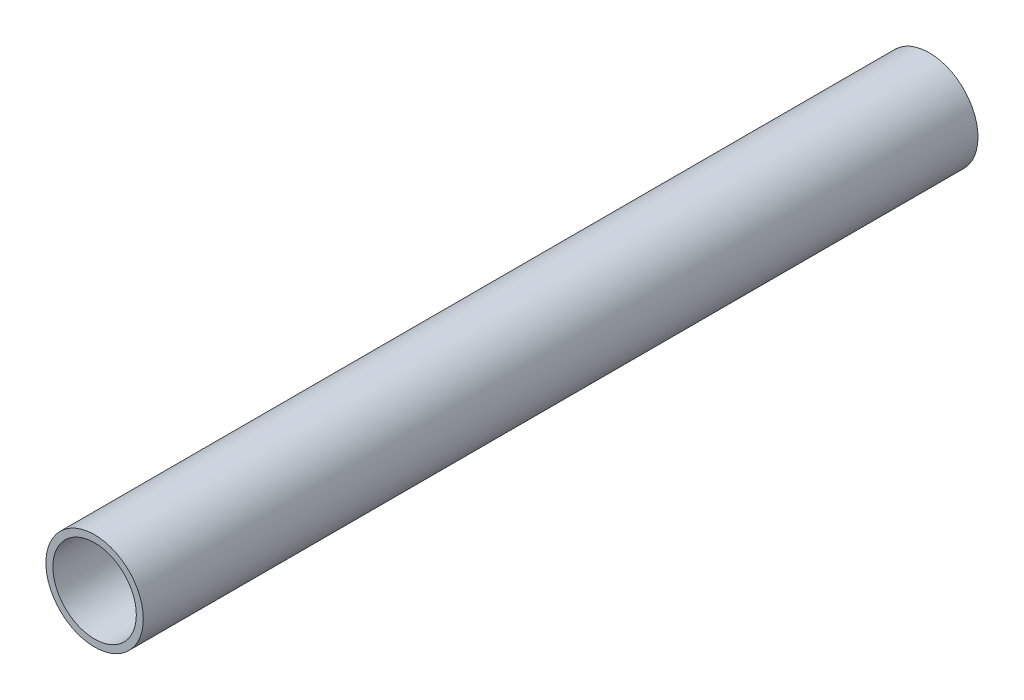
ISO-10303-21;
HEADER;
FILE_DESCRIPTION(('STEP AP214'),'2;1');
FILE_NAME('part.step','',(''),(''),'','','');
FILE_SCHEMA(('AUTOMOTIVE_DESIGN { 1 0 10303 214 1 1 1 1 }'));
ENDSEC;
DATA;
#1=APPLICATION_CONTEXT('core data for automotive mechanical design processes');
#2=APPLICATION_PROTOCOL_DEFINITION('international standard','automotive_design',2000,#1);
#3=PRODUCT_CONTEXT('',#1,'mechanical');
#4=PRODUCT('Part','Part','',(#3));
#5=PRODUCT_RELATED_PRODUCT_CATEGORY('part','',(#4));
#6=PRODUCT_DEFINITION_FORMATION('','',#4);
#7=PRODUCT_DEFINITION_CONTEXT('part definition',#1,'design');
#8=PRODUCT_DEFINITION('design','',#6,#7);
#9=PRODUCT_DEFINITION_SHAPE('','',#8);
#10=(LENGTH_UNIT() NAMED_UNIT(*) SI_UNIT(.MILLI.,.METRE.));
#11=(NAMED_UNIT(*) PLANE_ANGLE_UNIT() SI_UNIT($,.RADIAN.));
#12=(NAMED_UNIT(*) SI_UNIT($,.STERADIAN.) SOLID_ANGLE_UNIT());
#13=UNCERTAINTY_MEASURE_WITH_UNIT(LENGTH_MEASURE(1.E-05),#10,'distance_accuracy_value','');
#14=(GEOMETRIC_REPRESENTATION_CONTEXT(3) GLOBAL_UNCERTAINTY_ASSIGNED_CONTEXT((#13)) GLOBAL_UNIT_ASSIGNED_CONTEXT((#10,
#11,#12)) REPRESENTATION_CONTEXT('',''));
#15=CARTESIAN_POINT('',(0.,0.,0.));
#16=DIRECTION('',(0.,0.,1.));
#17=DIRECTION('',(1.,0.,0.));
#18=AXIS2_PLACEMENT_3D('',#15,#16,#17);
#19=CARTESIAN_POINT('',(0.,0.,33.3375));
#20=DIRECTION('',(0.,0.,1.));
#21=DIRECTION('',(1.,0.,0.));
#22=AXIS2_PLACEMENT_3D('',#19,#20,#21);
#23=PLANE('',#22);
#24=CARTESIAN_POINT('',(0.,0.,33.3375));
#25=DIRECTION('',(0.,0.,1.));
#26=DIRECTION('',(1.,0.,0.));
#27=AXIS2_PLACEMENT_3D('',#24,#25,#26);
#28=CIRCLE('',#27,3.889375);
#29=CARTESIAN_POINT('',(3.889375,0.,33.3375));
#30=VERTEX_POINT('',#29);
#31=EDGE_CURVE('E10',#30,#30,#28,.T.);
#32=ORIENTED_EDGE('',*,*,#31,.T.);
#33=EDGE_LOOP('',(#32));
#34=FACE_BOUND('',#33,.T.);
#35=CARTESIAN_POINT('',(0.,0.,33.3375));
#36=DIRECTION('',(0.,0.,1.));
#37=DIRECTION('',(1.,0.,0.));
#38=AXIS2_PLACEMENT_3D('',#35,#36,#37);
#39=CIRCLE('',#38,3.33375);
#40=CARTESIAN_POINT('',(3.33375,0.,33.3375));
#41=VERTEX_POINT('',#40);
#42=EDGE_CURVE('E51',#41,#41,#39,.T.);
#43=ORIENTED_EDGE('',*,*,#42,.F.);
#44=EDGE_LOOP('',(#43));
#45=FACE_BOUND('',#44,.T.);
#46=ADVANCED_FACE('F38',(#34,#45),#23,.T.);
#47=CARTESIAN_POINT('',(0.,0.,-33.3375));
#48=DIRECTION('',(0.,0.,1.));
#49=DIRECTION('',(1.,0.,0.));
#50=AXIS2_PLACEMENT_3D('',#47,#48,#49);
#51=PLANE('',#50);
#52=CARTESIAN_POINT('',(0.,0.,-33.3375));
#53=DIRECTION('',(0.,0.,1.));
#54=DIRECTION('',(1.,0.,0.));
#55=AXIS2_PLACEMENT_3D('',#52,#53,#54);
#56=CIRCLE('',#55,3.889375);
#57=CARTESIAN_POINT('',(3.889375,0.,-33.3375));
#58=VERTEX_POINT('',#57);
#59=EDGE_CURVE('E42',#58,#58,#56,.T.);
#60=ORIENTED_EDGE('',*,*,#59,.F.);
#61=EDGE_LOOP('',(#60));
#62=FACE_BOUND('',#61,.T.);
#63=CARTESIAN_POINT('',(0.,0.,-33.3375));
#64=DIRECTION('',(0.,0.,1.));
#65=DIRECTION('',(1.,0.,0.));
#66=AXIS2_PLACEMENT_3D('',#63,#64,#65);
#67=CIRCLE('',#66,3.33375);
#68=CARTESIAN_POINT('',(3.33375,0.,-33.3375));
#69=VERTEX_POINT('',#68);
#70=EDGE_CURVE('E53',#69,#69,#67,.T.);
#71=ORIENTED_EDGE('',*,*,#70,.T.);
#72=EDGE_LOOP('',(#71));
#73=FACE_BOUND('',#72,.T.);
#74=ADVANCED_FACE('F65',(#62,#73),#51,.F.);
#75=CARTESIAN_POINT('',(0.,0.,33.3375));
#76=DIRECTION('',(0.,0.,-1.));
#77=DIRECTION('',(-1.,0.,0.));
#78=AXIS2_PLACEMENT_3D('',#75,#76,#77);
#79=CYLINDRICAL_SURFACE('',#78,3.889375);
#80=ORIENTED_EDGE('',*,*,#31,.F.);
#81=EDGE_LOOP('',(#80));
#82=FACE_BOUND('',#81,.T.);
#83=ORIENTED_EDGE('',*,*,#59,.T.);
#84=EDGE_LOOP('',(#83));
#85=FACE_BOUND('',#84,.T.);
#86=ADVANCED_FACE('F40',(#82,#85),#79,.T.);
#87=CARTESIAN_POINT('',(0.,0.,33.3375));
#88=DIRECTION('',(0.,0.,-1.));
#89=DIRECTION('',(-1.,0.,0.));
#90=AXIS2_PLACEMENT_3D('',#87,#88,#89);
#91=CYLINDRICAL_SURFACE('',#90,3.33375);
#92=ORIENTED_EDGE('',*,*,#42,.T.);
#93=EDGE_LOOP('',(#92));
#94=FACE_BOUND('',#93,.T.);
#95=ORIENTED_EDGE('',*,*,#70,.F.);
#96=EDGE_LOOP('',(#95));
#97=FACE_BOUND('',#96,.T.);
#98=ADVANCED_FACE('F61',(#94,#97),#91,.F.);
#99=CLOSED_SHELL('',(#46,#74,#86,#98));
#100=MANIFOLD_SOLID_BREP('B2',#99);
#101=ADVANCED_BREP_SHAPE_REPRESENTATION('',(#18,#100),#14);
#102=SHAPE_DEFINITION_REPRESENTATION(#9,#101);
ENDSEC;
END-ISO-10303-21;
